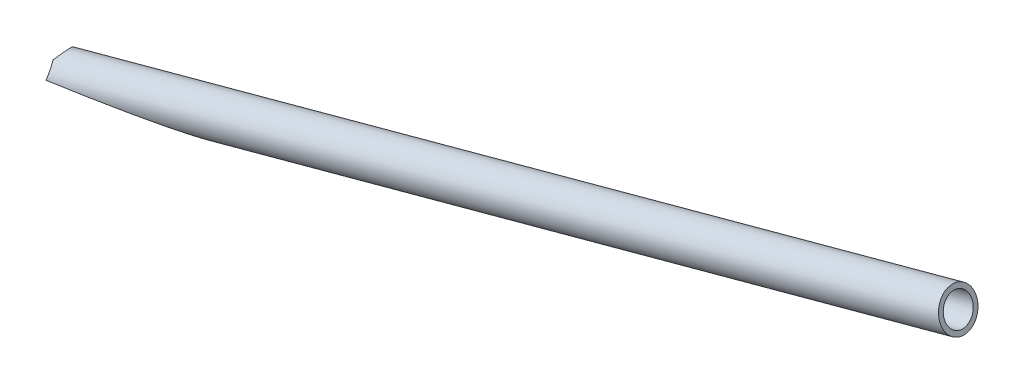
ISO-10303-21;
HEADER;
FILE_DESCRIPTION(('STEP AP214'),'2;1');
FILE_NAME('part.step','',(''),(''),'','','');
FILE_SCHEMA(('AUTOMOTIVE_DESIGN { 1 0 10303 214 1 1 1 1 }'));
ENDSEC;
DATA;
#1=APPLICATION_CONTEXT('core data for automotive mechanical design processes');
#2=APPLICATION_PROTOCOL_DEFINITION('international standard','automotive_design',2000,#1);
#3=PRODUCT_CONTEXT('',#1,'mechanical');
#4=PRODUCT('Part','Part','',(#3));
#5=PRODUCT_RELATED_PRODUCT_CATEGORY('part','',(#4));
#6=PRODUCT_DEFINITION_FORMATION('','',#4);
#7=PRODUCT_DEFINITION_CONTEXT('part definition',#1,'design');
#8=PRODUCT_DEFINITION('design','',#6,#7);
#9=PRODUCT_DEFINITION_SHAPE('','',#8);
#10=(LENGTH_UNIT() NAMED_UNIT(*) SI_UNIT(.MILLI.,.METRE.));
#11=(NAMED_UNIT(*) PLANE_ANGLE_UNIT() SI_UNIT($,.RADIAN.));
#12=(NAMED_UNIT(*) SI_UNIT($,.STERADIAN.) SOLID_ANGLE_UNIT());
#13=UNCERTAINTY_MEASURE_WITH_UNIT(LENGTH_MEASURE(1.E-05),#10,'distance_accuracy_value','');
#14=(GEOMETRIC_REPRESENTATION_CONTEXT(3) GLOBAL_UNCERTAINTY_ASSIGNED_CONTEXT((#13)) GLOBAL_UNIT_ASSIGNED_CONTEXT((#10,
#11,#12)) REPRESENTATION_CONTEXT('',''));
#15=CARTESIAN_POINT('',(0.,0.,0.));
#16=DIRECTION('',(0.,0.,1.));
#17=DIRECTION('',(1.,0.,0.));
#18=AXIS2_PLACEMENT_3D('',#15,#16,#17);
#19=CARTESIAN_POINT('',(0.,3.69149155687865E-12,-199.999999999991));
#20=DIRECTION('',(0.974346253790711,0.214414809831052,-0.0683788494281837));
#21=DIRECTION('',(-0.214917840654056,0.976632132263012,0.));
#22=AXIS2_PLACEMENT_3D('',#19,#20,#21);
#23=CYLINDRICAL_SURFACE('',#22,9.65);
#24=CARTESIAN_POINT('',(12.6578481651679,12.6663837757664,-201.033866445696));
#25=CARTESIAN_POINT('',(12.6398762361989,12.6624310107136,-201.253923955807));
#26=CARTESIAN_POINT('',(12.6161641519962,12.649437539128,-201.473326217625));
#27=CARTESIAN_POINT('',(12.5576373291854,12.605684867128,-201.908939145302));
#28=CARTESIAN_POINT('',(12.5228183198362,12.5749188292606,-202.125148549956));
#29=CARTESIAN_POINT('',(12.4427102833345,12.4962733643517,-202.552712250612));
#30=CARTESIAN_POINT('',(12.3974084851258,12.4483730236215,-202.764060275934));
#31=CARTESIAN_POINT('',(12.2972408079726,12.3364553283438,-203.180205559036));
#32=CARTESIAN_POINT('',(12.2423701766244,12.2724299581765,-203.384999501603));
#33=CARTESIAN_POINT('',(12.124658053771,12.1301230113847,-203.784933472554));
#34=CARTESIAN_POINT('',(12.0618933792813,12.0519760182954,-203.98014421948));
#35=CARTESIAN_POINT('',(11.9290777199722,11.8822852603161,-204.362116011763));
#36=CARTESIAN_POINT('',(11.8590234941935,11.7907355290988,-204.54887324525));
#37=CARTESIAN_POINT('',(11.639577281935,11.4978836537146,-205.095505661985));
#38=CARTESIAN_POINT('',(11.4808154367502,11.2782746536856,-205.4420263111));
#39=CARTESIAN_POINT('',(11.190432418675,10.8621725494696,-206.011512087881));
#40=CARTESIAN_POINT('',(11.062531713847,10.6745883920126,-206.243131008751));
#41=CARTESIAN_POINT('',(10.8005672499711,10.2806449109304,-206.686095715315));
#42=CARTESIAN_POINT('',(10.6665028890115,10.074283751703,-206.897439514796));
#43=CARTESIAN_POINT('',(10.394651135223,9.64460689978534,-207.300722045524));
#44=CARTESIAN_POINT('',(10.2568553377505,9.42125044950734,-207.49261137861));
#45=CARTESIAN_POINT('',(9.98049910331886,8.95976217598755,-207.856964681965));
#46=CARTESIAN_POINT('',(9.84193876950019,8.72163230341374,-208.029431208373));
#47=CARTESIAN_POINT('',(9.56275101636566,8.2247416337664,-208.360140206228));
#48=CARTESIAN_POINT('',(9.42217811115553,7.96558521989223,-208.517833583154));
#49=CARTESIAN_POINT('',(9.14612204176194,7.43362168019311,-208.813589596864));
#50=CARTESIAN_POINT('',(9.01063992840097,7.16081176286897,-208.951648196912));
#51=CARTESIAN_POINT('',(8.74862098129519,6.60243641710611,-209.207885168329));
#52=CARTESIAN_POINT('',(8.62207120699322,6.31689046169346,-209.326092656167));
#53=CARTESIAN_POINT('',(8.38212476996069,5.73296047073515,-209.542328562553));
#54=CARTESIAN_POINT('',(8.26872177554578,5.43458271090384,-209.640366712724));
#55=CARTESIAN_POINT('',(8.09708558806915,4.93229150344866,-209.784426704791));
#56=CARTESIAN_POINT('',(8.0334586344406,4.73197906142325,-209.836628232134));
#57=CARTESIAN_POINT('',(7.91581621951402,4.32627837312236,-209.931543955413));
#58=CARTESIAN_POINT('',(7.86180157750337,4.120889695881,-209.974257342721));
#59=CARTESIAN_POINT('',(7.7654314330872,3.70590242157028,-210.049468294951));
#60=CARTESIAN_POINT('',(7.72305609942978,3.49631164633629,-210.081983249724));
#61=CARTESIAN_POINT('',(7.65188291191024,3.07346281235492,-210.136108905582));
#62=CARTESIAN_POINT('',(7.62308030938959,2.86020606331912,-210.157723420564));
#63=CARTESIAN_POINT('',(7.5840301008006,2.46293430934048,-210.1869026467));
#64=CARTESIAN_POINT('',(7.57167243092039,2.27924527361716,-210.196069329884));
#65=CARTESIAN_POINT('',(7.55910229918952,1.91128205319511,-210.205392776827));
#66=CARTESIAN_POINT('',(7.55888415888533,1.72700818240388,-210.205553753145));
#67=CARTESIAN_POINT('',(7.57111146806392,1.35919510542339,-210.196486152877));
#68=CARTESIAN_POINT('',(7.58355042801215,1.17565557114066,-210.187262388026));
#69=CARTESIAN_POINT('',(7.62110775443539,0.810614053342008,-210.159196015921));
#70=CARTESIAN_POINT('',(7.64622639574477,0.6291121140785,-210.140353200172));
#71=CARTESIAN_POINT('',(7.70858828212274,0.269738017119927,-210.093026799924));
#72=CARTESIAN_POINT('',(7.74581564534785,0.0918614274016094,-210.064555841801));
#73=CARTESIAN_POINT('',(7.83142239912595,-0.259350894667046,-209.998087426645));
#74=CARTESIAN_POINT('',(7.87980181929446,-0.432686614957247,-209.960089944314));
#75=CARTESIAN_POINT('',(7.98648056129009,-0.774179351138876,-209.874755237889));
#76=CARTESIAN_POINT('',(8.04479360878868,-0.942328816094309,-209.827405076204));
#77=CARTESIAN_POINT('',(8.16982550922923,-1.27263780129534,-209.723710668539));
#78=CARTESIAN_POINT('',(8.2365465385888,-1.43479575652514,-209.667364092814));
#79=CARTESIAN_POINT('',(8.40421140879003,-1.81466956729474,-209.522384803946));
#80=CARTESIAN_POINT('',(8.5083666477454,-2.02943966014543,-209.429722458917));
#81=CARTESIAN_POINT('',(8.72617623861614,-2.44637242927899,-209.228533930753));
#82=CARTESIAN_POINT('',(8.8398341913527,-2.64853027532759,-209.120001722348));
#83=CARTESIAN_POINT('',(9.07340057883,-3.04044670567934,-208.88766387065));
#84=CARTESIAN_POINT('',(9.19331669182777,-3.23018938255688,-208.763839197655));
#85=CARTESIAN_POINT('',(9.43633379377179,-3.59708328812163,-208.501621201364));
#86=CARTESIAN_POINT('',(9.55943448758112,-3.77423567797539,-208.363229224496));
#87=CARTESIAN_POINT('',(9.80943586160389,-4.12036480178331,-208.068656995383));
#88=CARTESIAN_POINT('',(9.93635386438755,-4.28902114606731,-207.912115187394));
#89=CARTESIAN_POINT('',(10.1885057334834,-4.61312226082369,-207.584659514661));
#90=CARTESIAN_POINT('',(10.3137395843703,-4.7685669103586,-207.413745518384));
#91=CARTESIAN_POINT('',(10.5603523157501,-5.06598917617145,-207.058030023907));
#92=CARTESIAN_POINT('',(10.6817317832342,-5.20796884966165,-206.873230654905));
#93=CARTESIAN_POINT('',(10.9186642357365,-5.47807908518387,-206.490260349426));
#94=CARTESIAN_POINT('',(11.0342173351285,-5.60620991913046,-206.292089675611));
#95=CARTESIAN_POINT('',(11.2711711661053,-5.8627307823389,-205.858236808069));
#96=CARTESIAN_POINT('',(11.3915868902324,-5.98927515684062,-205.620917495461));
#97=CARTESIAN_POINT('',(11.6202910895961,-6.22333843088086,-205.131453026492));
#98=CARTESIAN_POINT('',(11.7285784422471,-6.33085556981799,-204.879306501032));
#99=CARTESIAN_POINT('',(11.9306695772683,-6.52575896575054,-204.361904630593));
#100=CARTESIAN_POINT('',(12.0244805976349,-6.61315529373897,-204.096655924703));
#101=CARTESIAN_POINT('',(12.1956089575202,-6.7668315764643,-203.554962332424));
#102=CARTESIAN_POINT('',(12.2729290110343,-6.8331150067368,-203.278519297263));
#103=CARTESIAN_POINT('',(12.4020137609956,-6.93771187566469,-202.747105869295));
#104=CARTESIAN_POINT('',(12.4556327981382,-6.97826712946554,-202.493024662068));
#105=CARTESIAN_POINT('',(12.5474293090014,-7.04134963548109,-201.979881023221));
#106=CARTESIAN_POINT('',(12.5856078711688,-7.06387815856538,-201.720818944068));
#107=CARTESIAN_POINT('',(12.6458937918598,-7.09060866253849,-201.200024058387));
#108=CARTESIAN_POINT('',(12.6680090834415,-7.0948196948951,-200.938292635004));
#109=CARTESIAN_POINT('',(12.6959505601862,-7.08488307912286,-200.414316398544));
#110=CARTESIAN_POINT('',(12.7017775756706,-7.07073636686353,-200.152071612319));
#111=CARTESIAN_POINT('',(12.6974854908949,-7.02638106067723,-199.653019217639));
#112=CARTESIAN_POINT('',(12.6887614669976,-6.99774152898652,-199.416056918154));
#113=CARTESIAN_POINT('',(12.6583225686202,-6.92574074384044,-198.945245155895));
#114=CARTESIAN_POINT('',(12.6366086934595,-6.88238062296251,-198.711395455081));
#115=CARTESIAN_POINT('',(12.5807804625198,-6.78136258120894,-198.248327557074));
#116=CARTESIAN_POINT('',(12.5466662905722,-6.72370487229573,-198.019109291273));
#117=CARTESIAN_POINT('',(12.4668217427915,-6.59459963042537,-197.566661851318));
#118=CARTESIAN_POINT('',(12.4210908343341,-6.5231514652156,-197.343432952293));
#119=CARTESIAN_POINT('',(12.3172783751722,-6.36445467237416,-196.89695388946));
#120=CARTESIAN_POINT('',(12.2588404053372,-6.27676404171385,-196.673943996451));
#121=CARTESIAN_POINT('',(12.1317638837514,-6.08788157543605,-196.236738517814));
#122=CARTESIAN_POINT('',(12.0631251871095,-5.98668954804671,-196.022543057441));
#123=CARTESIAN_POINT('',(11.9169096366725,-5.77132538185922,-195.603811985363));
#124=CARTESIAN_POINT('',(11.83932813273,-5.6571464904677,-195.399281477956));
#125=CARTESIAN_POINT('',(11.6766558111603,-5.41634718769224,-195.000796691486));
#126=CARTESIAN_POINT('',(11.5915642830915,-5.28972559911136,-194.806843415836));
#127=CARTESIAN_POINT('',(11.4048782941431,-5.00863538903161,-194.407785078388));
#128=CARTESIAN_POINT('',(11.3025254182596,-4.85264633652122,-194.204103746854));
#129=CARTESIAN_POINT('',(11.0925744884397,-4.52595075442271,-193.81176089959));
#130=CARTESIAN_POINT('',(10.9849756704016,-4.35524207803688,-193.623101582504));
#131=CARTESIAN_POINT('',(10.7670413505968,-3.99922801986563,-193.261649448399));
#132=CARTESIAN_POINT('',(10.6567048707283,-3.81391736815598,-193.088862408939));
#133=CARTESIAN_POINT('',(10.4362267553983,-3.42875620127612,-192.760228241072));
#134=CARTESIAN_POINT('',(10.3260850839405,-3.22890874221459,-192.604377569174));
#135=CARTESIAN_POINT('',(10.1299485626497,-2.8539329609307,-192.338667943792));
#136=CARTESIAN_POINT('',(10.0433427683416,-2.68132491784202,-192.225697398896));
#137=CARTESIAN_POINT('',(9.87452059559322,-2.32645146402938,-192.012363665152));
#138=CARTESIAN_POINT('',(9.79230330811601,-2.14418806902578,-191.911997859482));
#139=CARTESIAN_POINT('',(9.63469280769146,-1.77039481104267,-191.724878296405));
#140=CARTESIAN_POINT('',(9.55928797388502,-1.57888161731496,-191.638101166237));
#141=CARTESIAN_POINT('',(9.41767062537105,-1.18668673887575,-191.478917985521));
#142=CARTESIAN_POINT('',(9.35145605538135,-0.986007117501652,-191.406508720226));
#143=CARTESIAN_POINT('',(9.24135527184902,-0.612218316694561,-191.288358979379));
#144=CARTESIAN_POINT('',(9.19558953536006,-0.440436020904675,-191.240168817652));
#145=CARTESIAN_POINT('',(9.11339257848526,-0.0920091329278726,-191.154684946472));
#146=CARTESIAN_POINT('',(9.07695930815268,0.0846343819985869,-191.117388843804));
#147=CARTESIAN_POINT('',(9.01452615936448,0.441596748755765,-191.054034276173));
#148=CARTESIAN_POINT('',(8.98851771799567,0.621912455790904,-191.027966586916));
#149=CARTESIAN_POINT('',(8.94756888078086,0.985066593299672,-190.98712869965));
#150=CARTESIAN_POINT('',(8.93262869844091,1.16790507236812,-190.972358719574));
#151=CARTESIAN_POINT('',(8.91401972585638,1.53447750382371,-190.953982547385));
#152=CARTESIAN_POINT('',(8.91033662043258,1.71821002107966,-190.95036217671));
#153=CARTESIAN_POINT('',(8.91387078972847,2.08541627583703,-190.953847422917));
#154=CARTESIAN_POINT('',(8.92108807680007,2.26889001304496,-190.960953051952));
#155=CARTESIAN_POINT('',(8.95811723526415,2.81760650173775,-190.997579228416));
#156=CARTESIAN_POINT('',(9.00331539667944,3.18094003101272,-191.042418106262));
#157=CARTESIAN_POINT('',(9.11085621988236,3.80692596846384,-191.152037901851));
#158=CARTESIAN_POINT('',(9.1662148620465,4.07229629097734,-191.209166269455));
#159=CARTESIAN_POINT('',(9.29128777555287,4.59517682949033,-191.341461351586));
#160=CARTESIAN_POINT('',(9.36100951892657,4.85268287391713,-191.416637458361));
#161=CARTESIAN_POINT('',(9.51143702822177,5.3598057475192,-191.583634269941));
#162=CARTESIAN_POINT('',(9.59217629726837,5.60939553516358,-191.675506038663));
#163=CARTESIAN_POINT('',(9.76136101453103,6.09962689397889,-191.87455190867));
#164=CARTESIAN_POINT('',(9.84980603554231,6.34026896015506,-191.981725161854));
#165=CARTESIAN_POINT('',(10.0648306089876,6.89826710437952,-192.25217063275));
#166=CARTESIAN_POINT('',(10.1936003944399,7.21176763098223,-192.421686085692));
#167=CARTESIAN_POINT('',(10.4551295970883,7.82158249574692,-192.786763964987));
#168=CARTESIAN_POINT('',(10.5878906545587,8.11788961729504,-192.982337216707));
#169=CARTESIAN_POINT('',(10.8525496017723,8.69178504600308,-193.39901667652));
#170=CARTESIAN_POINT('',(10.9844484093569,8.96939788957054,-193.620088340729));
#171=CARTESIAN_POINT('',(11.2431791883075,9.50423398046338,-194.087939836212));
#172=CARTESIAN_POINT('',(11.3700136670406,9.76146738140074,-194.334706721756));
#173=CARTESIAN_POINT('',(11.6647308766876,10.3540018970479,-194.961356404109));
#174=CARTESIAN_POINT('',(11.8281366165434,10.6780996001629,-195.35435071307));
#175=CARTESIAN_POINT('',(12.0497030311405,11.1207396014951,-195.982050304333));
#176=CARTESIAN_POINT('',(12.1196170109733,11.2609989127831,-196.197579746624));
#177=CARTESIAN_POINT('',(12.2499634723657,11.5252872416254,-196.641167073955));
#178=CARTESIAN_POINT('',(12.3103981994065,11.649320101804,-196.869221974584));
#179=CARTESIAN_POINT('',(12.4090131975076,11.8560136413997,-197.290144205675));
#180=CARTESIAN_POINT('',(12.4492265683064,11.9419857208629,-197.48091517415));
#181=CARTESIAN_POINT('',(12.5215342432021,12.1010383555539,-197.869234881479));
#182=CARTESIAN_POINT('',(12.5536304449212,12.1741219226313,-198.066782023921));
#183=CARTESIAN_POINT('',(12.6088107884642,12.3061753154177,-198.467449474263));
#184=CARTESIAN_POINT('',(12.6319087051675,12.3651666599978,-198.670560750106));
#185=CARTESIAN_POINT('',(12.6684094192992,12.4681164823572,-199.08135055032));
#186=CARTESIAN_POINT('',(12.6818153952689,12.5120798861615,-199.289027554282));
#187=CARTESIAN_POINT('',(12.7000984010507,12.5917063866263,-199.751613608959));
#188=CARTESIAN_POINT('',(12.7025883320464,12.6236785259711,-200.007269209912));
#189=CARTESIAN_POINT('',(12.6919341974055,12.6633222092557,-200.520201643505));
#190=CARTESIAN_POINT('',(12.6787871505547,12.6709891183438,-200.77747877599));
#191=CARTESIAN_POINT('',(12.6578481651679,12.6663837757664,-201.033866445696));
#192=B_SPLINE_CURVE_WITH_KNOTS('',3,(#24,#25,#26,#27,#28,#29,#30,#31,#32,#33,#34,#35,#36,#37,
#38,#39,#40,#41,#42,#43,#44,#45,#46,#47,#48,#49,#50,#51,#52,#53,#54,#55,#56,#57,#58,#59,#60,#61,
#62,#63,#64,#65,#66,#67,#68,#69,#70,#71,#72,#73,#74,#75,#76,#77,#78,#79,#80,#81,#82,#83,#84,#85,
#86,#87,#88,#89,#90,#91,#92,#93,#94,#95,#96,#97,#98,#99,#100,#101,#102,#103,#104,#105,#106,#107,
#108,#109,#110,#111,#112,#113,#114,#115,#116,#117,#118,#119,#120,#121,#122,#123,#124,#125,#126,
#127,#128,#129,#130,#131,#132,#133,#134,#135,#136,#137,#138,#139,#140,#141,#142,#143,#144,#145,
#146,#147,#148,#149,#150,#151,#152,#153,#154,#155,#156,#157,#158,#159,#160,#161,#162,#163,#164,
#165,#166,#167,#168,#169,#170,#171,#172,#173,#174,#175,#176,#177,#178,#179,#180,#181,#182,#183,
#184,#185,#186,#187,#188,#189,#190,#191),.UNSPECIFIED.,.T.,.F.,(4,2,2,2,2,2,2,2,2,2,2,2,2,2,2,2,
2,2,2,2,2,2,2,2,2,2,2,2,2,2,2,2,2,2,2,2,2,2,2,2,2,2,2,2,2,2,2,2,2,2,2,2,2,2,2,2,2,2,2,2,2,2,2,2,
2,2,2,2,2,2,2,2,2,2,2,2,2,2,2,2,2,2,2,4),(0.,0.662180797317108,1.32461651833598,
1.98786356585248,2.65144096101996,3.30899916252157,3.96685097600643,5.28161859991612,
6.25348755047201,7.22545161128621,8.19982489522394,9.17406979657794,10.1762272565796,
11.1785904543998,12.1794703537284,13.1798661940748,13.8291444890904,14.4784780976482,
15.1266983991938,15.7746917407832,16.3271164713363,16.8792827944677,17.4311661540699,
17.9830614763569,18.5342358301381,19.08541164764,19.6373553164947,20.1894421513306,
20.9564461378308,21.723742090534,22.4920026611235,23.2601922850189,24.0478239229649,
24.8354627699721,25.6229810850531,26.4104839348227,27.2933016159349,28.1762009420277,
29.0586573884357,29.9409684926077,30.7283649551954,31.5157059020922,32.3026577453998,
33.0895694718346,33.8052827234804,34.5209409218238,35.236588511135,35.9522689186201,
36.6914632398829,37.4306680616708,38.1702590095303,38.9099199971858,39.7376897518056,
40.565580438167,41.3937712950054,42.2217885396857,42.8924433657551,43.5629587286959,
44.2323078163634,44.9015069708435,45.4535038352787,46.005379345253,46.5568006133241,
47.108232518001,47.6589628961732,48.2096938984125,49.3117634310654,50.1418498546909,
50.9723692047481,51.805472821664,52.6385302808955,53.7739329542354,54.9098087949824,
56.0441634970833,57.1779494303059,58.776333526467,59.5750370167639,60.3735510204845,
61.012195919492,61.6506913785524,62.2882055298104,62.9255105087778,63.69686625382,
64.4683690826151),.UNSPECIFIED.);
#193=CARTESIAN_POINT('',(12.6676672933685,12.6676672933722,-200.905651889248));
#194=VERTEX_POINT('',#193);
#195=CARTESIAN_POINT('',(12.1046465312153,12.1046465312189,-203.842854714176));
#196=VERTEX_POINT('',#195);
#197=EDGE_CURVE('E117',#194,#196,#192,.T.);
#198=ORIENTED_EDGE('',*,*,#197,.T.);
#199=CARTESIAN_POINT('',(12.6200439898743,12.6580645822304,-201.031213378576));
#200=CARTESIAN_POINT('',(12.5514884848631,12.6429822058329,-201.216385667732));
#201=CARTESIAN_POINT('',(12.4895737586561,12.6236294874,-201.403629018516));
#202=CARTESIAN_POINT('',(12.3792986976069,12.5759363659917,-201.78100295267));
#203=CARTESIAN_POINT('',(12.3309406182175,12.5475944691342,-201.971134010934));
#204=CARTESIAN_POINT('',(12.24801376047,12.4816397782159,-202.352918840367));
#205=CARTESIAN_POINT('',(12.2134537988497,12.4440210812058,-202.544573505586));
#206=CARTESIAN_POINT('',(12.1583159211233,12.3594618010821,-202.927833360554));
#207=CARTESIAN_POINT('',(12.1377374584449,12.3125215824632,-203.119438551944));
#208=CARTESIAN_POINT('',(12.1106398658542,12.2094418756148,-203.501234236045));
#209=CARTESIAN_POINT('',(12.104125547096,12.1532992464289,-203.691424222468));
#210=CARTESIAN_POINT('',(12.1051954700346,12.0321699607772,-204.068928812501));
#211=CARTESIAN_POINT('',(12.1127798655472,11.9671832078299,-204.25624338472));
#212=CARTESIAN_POINT('',(12.1420157599399,11.8289200408482,-204.62663172299));
#213=CARTESIAN_POINT('',(12.1636649632903,11.7556449811669,-204.809706176027));
#214=CARTESIAN_POINT('',(12.2209402539724,11.6015275862091,-205.170398515698));
#215=CARTESIAN_POINT('',(12.2565662331823,11.5206853094748,-205.348016444532));
#216=CARTESIAN_POINT('',(12.341327368083,11.352951478837,-205.695386202557));
#217=CARTESIAN_POINT('',(12.3903621356412,11.2661083271138,-205.865185941131));
#218=CARTESIAN_POINT('',(12.5018137083355,11.0868879589336,-206.197299583663));
#219=CARTESIAN_POINT('',(12.564230340948,10.9945108138338,-206.359613584096));
#220=CARTESIAN_POINT('',(12.7021035467224,10.8053816593983,-206.675902831898));
#221=CARTESIAN_POINT('',(12.7775585042511,10.7086301931985,-206.829879109328));
#222=CARTESIAN_POINT('',(12.9410686410392,10.5119670178944,-207.128854859227));
#223=CARTESIAN_POINT('',(13.0291241362175,10.4120552296039,-207.273854106495));
#224=CARTESIAN_POINT('',(13.2203333559997,10.2070483017232,-207.558967652489));
#225=CARTESIAN_POINT('',(13.3238850608608,10.1018902766045,-207.698769582186));
#226=CARTESIAN_POINT('',(13.543108136242,9.89087509280354,-207.968053098162));
#227=CARTESIAN_POINT('',(13.6587842298201,9.78501767683164,-208.097530627728));
#228=CARTESIAN_POINT('',(13.9013545866516,9.57393056780113,-208.346043280068));
#229=CARTESIAN_POINT('',(14.0282486905499,9.46870086584832,-208.46507855113));
#230=CARTESIAN_POINT('',(14.2923114754155,9.26000643984434,-208.692879447019));
#231=CARTESIAN_POINT('',(14.4294823530172,9.15654209897036,-208.801642864968));
#232=CARTESIAN_POINT('',(14.7745148319193,8.90816557137128,-209.054177572966));
#233=CARTESIAN_POINT('',(14.9872698523371,8.76470252408172,-209.19271823896));
#234=CARTESIAN_POINT('',(15.4288275781258,8.48568145048533,-209.450893342316));
#235=CARTESIAN_POINT('',(15.6576363490334,8.35012644786337,-209.570520577535));
#236=CARTESIAN_POINT('',(16.1287247291115,8.08817665960097,-209.792903474185));
#237=CARTESIAN_POINT('',(16.3710221577666,7.96179452500053,-209.895636072929));
#238=CARTESIAN_POINT('',(16.866349456575,7.71904788174814,-210.086135155714));
#239=CARTESIAN_POINT('',(17.1193834798109,7.60268730330332,-210.173895781231));
#240=CARTESIAN_POINT('',(17.5949672642718,7.39703043801438,-210.324126353507));
#241=CARTESIAN_POINT('',(17.8163350320472,7.30630334763399,-210.388413738999));
#242=CARTESIAN_POINT('',(18.2640264612156,7.13209243953741,-210.508780500765));
#243=CARTESIAN_POINT('',(18.4903491494395,7.04860721518835,-210.564861472484));
#244=CARTESIAN_POINT('',(18.9472379275603,6.88854175454515,-210.669918455592));
#245=CARTESIAN_POINT('',(19.1778072103569,6.81196699245586,-210.718888852633));
#246=CARTESIAN_POINT('',(19.6422689710235,6.6654463303555,-210.810610215522));
#247=CARTESIAN_POINT('',(19.8761616744349,6.59550088273207,-210.853360757029));
#248=CARTESIAN_POINT('',(20.347366425455,6.46164637472803,-210.933582707817));
#249=CARTESIAN_POINT('',(20.5846868862218,6.39775690022453,-210.97103716882));
#250=CARTESIAN_POINT('',(21.0615109385366,6.27585265044731,-211.041223527465));
#251=CARTESIAN_POINT('',(21.3010144918539,6.21783777251105,-211.07395550764));
#252=CARTESIAN_POINT('',(21.7816903373641,6.10729438366822,-211.135301961545));
#253=CARTESIAN_POINT('',(22.0228618569443,6.05476349314119,-211.163918223228));
#254=CARTESIAN_POINT('',(22.5066394643358,5.9547635058449,-211.217575499977));
#255=CARTESIAN_POINT('',(22.7492455527912,5.90729441134851,-211.242616513437));
#256=CARTESIAN_POINT('',(23.4304079425107,5.78088841577531,-211.308394515495));
#257=CARTESIAN_POINT('',(23.8702810300244,5.70719809335178,-211.345639791999));
#258=CARTESIAN_POINT('',(24.7526566217972,5.57297462538384,-211.412165538318));
#259=CARTESIAN_POINT('',(25.195159555099,5.51244369081415,-211.441444669908));
#260=CARTESIAN_POINT('',(26.0822146486873,5.4027795153992,-211.493635498939));
#261=CARTESIAN_POINT('',(26.5267679162322,5.35365341672946,-211.516543208103));
#262=CARTESIAN_POINT('',(27.4170592195438,5.26536310083526,-211.557175352317));
#263=CARTESIAN_POINT('',(27.8627971915658,5.22619835816772,-211.574900060768));
#264=CARTESIAN_POINT('',(28.7562030186817,5.1564789071436,-211.606126939483));
#265=CARTESIAN_POINT('',(29.203872914792,5.12594590396902,-211.619618474289));
#266=CARTESIAN_POINT('',(30.0997603044461,5.07254416136586,-211.643029706637));
#267=CARTESIAN_POINT('',(30.5479778040508,5.04967550755161,-211.652949364279));
#268=CARTESIAN_POINT('',(31.4446124277796,5.01069634313956,-211.669763132895));
#269=CARTESIAN_POINT('',(31.8930294396718,4.99458363841084,-211.676658226191));
#270=CARTESIAN_POINT('',(32.7900739306135,4.9683369105392,-211.687849346989));
#271=CARTESIAN_POINT('',(33.2387014135455,4.95820300240095,-211.692145324496));
#272=CARTESIAN_POINT('',(34.5899039142449,4.93566812500637,-211.701687960307));
#273=CARTESIAN_POINT('',(35.4926423121933,4.93134232373912,-211.703500890956));
#274=CARTESIAN_POINT('',(37.2980365951206,4.93986616259208,-211.699901490167));
#275=CARTESIAN_POINT('',(38.20069247161,4.95271685908404,-211.694488714341));
#276=CARTESIAN_POINT('',(40.0042457084497,4.99244224757276,-211.677584585983));
#277=CARTESIAN_POINT('',(40.9051436470414,5.01929546313457,-211.666102541853));
#278=CARTESIAN_POINT('',(42.7064398868834,5.08465937236917,-211.637761874703));
#279=CARTESIAN_POINT('',(43.6068381775237,5.12317030476219,-211.620903141582));
#280=CARTESIAN_POINT('',(45.3050222949321,5.20513608007349,-211.584400492051));
#281=CARTESIAN_POINT('',(46.1028712986815,5.24753581073377,-211.565288843703));
#282=CARTESIAN_POINT('',(47.6980842772109,5.33911916725714,-211.523295703276));
#283=CARTESIAN_POINT('',(48.4954482484094,5.38830284261876,-211.500414183689));
#284=CARTESIAN_POINT('',(50.0896937137597,5.49267076962071,-211.450934649207));
#285=CARTESIAN_POINT('',(50.8865751906413,5.54785522460118,-211.424336508362));
#286=CARTESIAN_POINT('',(52.4798150391159,5.66360120655427,-211.367399816331));
#287=CARTESIAN_POINT('',(53.2761734080669,5.72416276047693,-211.337061246397));
#288=CARTESIAN_POINT('',(55.6656667181384,5.91322601439389,-211.240277521703));
#289=CARTESIAN_POINT('',(57.2580003630176,6.04902480507719,-211.168102011288));
#290=CARTESIAN_POINT('',(60.4402742472308,6.33715819308004,-211.007165085053));
#291=CARTESIAN_POINT('',(62.0302145513468,6.48949233436032,-210.918404126606));
#292=CARTESIAN_POINT('',(65.1982126953933,6.80808869020896,-210.722629556941));
#293=CARTESIAN_POINT('',(66.7762858399357,6.97426469239093,-210.615725171749));
#294=CARTESIAN_POINT('',(69.141047857056,7.23401573800547,-210.438866717435));
#295=CARTESIAN_POINT('',(69.9289368434117,7.32235038433252,-210.377161251094));
#296=CARTESIAN_POINT('',(71.5038117264707,7.5025209964299,-210.24765847044));
#297=CARTESIAN_POINT('',(72.290797628826,7.59435694016293,-210.179861194466));
#298=CARTESIAN_POINT('',(73.8632323078545,7.78152513854197,-210.037513766333));
#299=CARTESIAN_POINT('',(74.6486817439112,7.87685513168588,-209.962967937754));
#300=CARTESIAN_POINT('',(76.2183524948895,8.0711963403232,-209.80619123137));
#301=CARTESIAN_POINT('',(77.0025738234531,8.17020751461937,-209.723960439553));
#302=CARTESIAN_POINT('',(78.5694650090496,8.37212306836393,-209.550667932541));
#303=CARTESIAN_POINT('',(79.35213500719,8.47502707484534,-209.459607062044));
#304=CARTESIAN_POINT('',(80.9156232174877,8.68507312150091,-209.26713748386));
#305=CARTESIAN_POINT('',(81.6964414823521,8.79221503947626,-209.165729074409));
#306=CARTESIAN_POINT('',(82.8657249348383,8.95647444247092,-209.004300544557));
#307=CARTESIAN_POINT('',(83.2550879573624,9.01180776403986,-208.948949835966));
#308=CARTESIAN_POINT('',(84.0331248065767,9.12375328635563,-208.834790642357));
#309=CARTESIAN_POINT('',(84.4217986329698,9.18036548765363,-208.775982155847));
#310=CARTESIAN_POINT('',(85.1984458270446,9.29499112524384,-208.654485365895));
#311=CARTESIAN_POINT('',(85.5864189725726,9.35300494279544,-208.591795999385));
#312=CARTESIAN_POINT('',(86.3614042452678,9.47055317708693,-208.462049892733));
#313=CARTESIAN_POINT('',(86.7484163763974,9.53008758754578,-208.394993170628));
#314=CARTESIAN_POINT('',(87.523089227308,9.65112955145953,-208.255559651624));
#315=CARTESIAN_POINT('',(87.9107445083886,9.71264503413468,-208.183159429265));
#316=CARTESIAN_POINT('',(88.6846032741595,9.83760308978128,-208.032505783851));
#317=CARTESIAN_POINT('',(89.070806782642,9.90104563101532,-207.954252457162));
#318=CARTESIAN_POINT('',(89.8411869138308,10.0301179071237,-207.790864881586));
#319=CARTESIAN_POINT('',(90.2253644627497,10.0957465197356,-207.705734132314));
#320=CARTESIAN_POINT('',(90.9913047539026,10.2296107628735,-207.527120209335));
#321=CARTESIAN_POINT('',(91.3730676611105,10.2978462130018,-207.433637612994));
#322=CARTESIAN_POINT('',(92.1356648066775,10.4379107807442,-207.235663070737));
#323=CARTESIAN_POINT('',(92.5164789248328,10.5097594037138,-207.131107006269));
#324=CARTESIAN_POINT('',(93.2737722377485,10.6575553149253,-206.908294257877));
#325=CARTESIAN_POINT('',(93.6502469861494,10.7335064199098,-206.790024694114));
#326=CARTESIAN_POINT('',(94.2079465866371,10.8511546111089,-206.599084257103));
#327=CARTESIAN_POINT('',(94.3920050669681,10.8908363126328,-206.533450710606));
#328=CARTESIAN_POINT('',(94.7576857679831,10.97176210685,-206.396622389169));
#329=CARTESIAN_POINT('',(94.9393083062722,11.0130059931264,-206.325428347645));
#330=CARTESIAN_POINT('',(95.2990274551936,11.0973087998041,-206.176330719481));
#331=CARTESIAN_POINT('',(95.4771290202143,11.1403648565339,-206.098437529848));
#332=CARTESIAN_POINT('',(95.8287297791837,11.2287659281394,-205.934101184009));
#333=CARTESIAN_POINT('',(96.0022312104541,11.2741097979627,-205.847662284556));
#334=CARTESIAN_POINT('',(96.2460612748323,11.3412024198946,-205.715690229815));
#335=CARTESIAN_POINT('',(96.3191788796894,11.3617725081102,-205.674710671696));
#336=CARTESIAN_POINT('',(96.4638252677863,11.4035282025346,-205.590327436479));
#337=CARTESIAN_POINT('',(96.5353538950091,11.4247138687179,-205.5469235228));
#338=CARTESIAN_POINT('',(96.7476837092025,11.4895024116442,-205.412148137834));
#339=CARTESIAN_POINT('',(96.8855838308283,11.5341622629872,-205.316552981747));
#340=CARTESIAN_POINT('',(97.150851762227,11.627687734765,-205.10883488979));
#341=CARTESIAN_POINT('',(97.2780131777058,11.6766096908896,-204.996469667799));
#342=CARTESIAN_POINT('',(97.5082767013584,11.7786192471229,-204.750952475762));
#343=CARTESIAN_POINT('',(97.6115719705706,11.8316683958427,-204.61798307947));
#344=CARTESIAN_POINT('',(97.7277838316738,11.9102402674347,-204.409168052959));
#345=CARTESIAN_POINT('',(97.7588940422864,11.9345100994498,-204.343122912173));
#346=CARTESIAN_POINT('',(97.8098503516197,11.983220399193,-204.206857663134));
#347=CARTESIAN_POINT('',(97.8297100395755,12.0076606248115,-204.136642705306));
#348=CARTESIAN_POINT('',(97.8561048707895,12.0562187051955,-203.992915195378));
#349=CARTESIAN_POINT('',(97.862531901466,12.0803324039892,-203.919380717226));
#350=CARTESIAN_POINT('',(97.8608449443811,12.1271551745814,-203.772013508382));
#351=CARTESIAN_POINT('',(97.8527274757564,12.149863908791,-203.698180710515));
#352=CARTESIAN_POINT('',(97.8243346388665,12.1913351050686,-203.558958435126));
#353=CARTESIAN_POINT('',(97.8051580046127,12.2102689663802,-203.493386756856));
#354=CARTESIAN_POINT('',(97.7573691708178,12.2461981752298,-203.365273094501));
#355=CARTESIAN_POINT('',(97.7287530138278,12.2631927056891,-203.302732393765));
#356=CARTESIAN_POINT('',(97.6402190378018,12.3070981670527,-203.136442163219));
#357=CARTESIAN_POINT('',(97.5727630149376,12.3321037069075,-203.036234222381));
#358=CARTESIAN_POINT('',(97.4234703976237,12.3774029777725,-202.845966025611));
#359=CARTESIAN_POINT('',(97.3415817096239,12.397679000165,-202.755944538087));
#360=CARTESIAN_POINT('',(97.1424313459732,12.4401333891732,-202.558544021319));
#361=CARTESIAN_POINT('',(97.0219681632058,12.4610278187408,-202.454166235038));
#362=CARTESIAN_POINT('',(96.7715582384389,12.4983461167863,-202.256423177481));
#363=CARTESIAN_POINT('',(96.6415926943373,12.5147608001691,-202.16308075137));
#364=CARTESIAN_POINT('',(96.3748667805635,12.5443145511815,-201.984538160453));
#365=CARTESIAN_POINT('',(96.2380735401839,12.5574354720409,-201.899384632175));
#366=CARTESIAN_POINT('',(95.9603964303612,12.5810518750144,-201.736059491067));
#367=CARTESIAN_POINT('',(95.8195167284031,12.5915499337318,-201.65788107508));
#368=CARTESIAN_POINT('',(95.4020328593421,12.61932853171,-201.436754847414));
#369=CARTESIAN_POINT('',(95.1212723202833,12.6338147687179,-201.301328766821));
#370=CARTESIAN_POINT('',(94.5529763049756,12.6575933833258,-201.044875288526));
#371=CARTESIAN_POINT('',(94.2654361983587,12.6668820973004,-200.923858094528));
#372=CARTESIAN_POINT('',(93.6852816387775,12.6816369274981,-200.692490654308));
#373=CARTESIAN_POINT('',(93.3926572720788,12.6870944447402,-200.582164879546));
#374=CARTESIAN_POINT('',(92.8042621868645,12.6950481181495,-200.370116020165));
#375=CARTESIAN_POINT('',(92.508491130979,12.6975439534873,-200.268393868657));
#376=CARTESIAN_POINT('',(91.9141785159529,12.7001777925676,-200.07179747313));
#377=CARTESIAN_POINT('',(91.6156333942756,12.7003121626215,-199.97693400617));
#378=CARTESIAN_POINT('',(91.0167410592834,12.6986463530164,-199.793052187221));
#379=CARTESIAN_POINT('',(90.7163937292489,12.6968460466839,-199.704034218372));
#380=CARTESIAN_POINT('',(90.1147397802063,12.6916354250163,-199.531107244224));
#381=CARTESIAN_POINT('',(89.8134352846946,12.688227536365,-199.447190752934));
#382=CARTESIAN_POINT('',(89.2096920802098,12.6800452932953,-199.28366241442));
#383=CARTESIAN_POINT('',(88.907253401812,12.6752709754553,-199.204050452035));
#384=CARTESIAN_POINT('',(88.0044501555584,12.6593000784742,-198.972374555948));
#385=CARTESIAN_POINT('',(87.4027041566872,12.6463961712438,-198.825802123352));
#386=CARTESIAN_POINT('',(86.1965412448047,12.6170996445048,-198.544410972964));
#387=CARTESIAN_POINT('',(85.5921241530911,12.6007067880085,-198.409593054477));
#388=CARTESIAN_POINT('',(84.3811470253031,12.5651712692477,-198.149682951077));
#389=CARTESIAN_POINT('',(83.7745865345298,12.5460279845092,-198.024592977686));
#390=CARTESIAN_POINT('',(82.5598848965964,12.5055447177883,-197.782710376516));
#391=CARTESIAN_POINT('',(81.9517437267676,12.4842047041309,-197.66591786842));
#392=CARTESIAN_POINT('',(80.733358131043,12.4397191931526,-197.439389333693));
#393=CARTESIAN_POINT('',(80.1231119672938,12.4165712710577,-197.329663156982));
#394=CARTESIAN_POINT('',(78.9015607454161,12.3688303396915,-197.116611336968));
#395=CARTESIAN_POINT('',(78.2902556816047,12.3442373226412,-197.013285728127));
#396=CARTESIAN_POINT('',(76.4551722476385,12.2687235586666,-196.711922140551));
#397=CARTESIAN_POINT('',(75.2300519312583,12.2160615913811,-196.522465531474));
#398=CARTESIAN_POINT('',(72.7790687345251,12.1079428654596,-196.16297312466));
#399=CARTESIAN_POINT('',(71.5532099786209,12.0524905848626,-195.992907555117));
#400=CARTESIAN_POINT('',(69.0993236039085,11.9400991416145,-195.669488579463));
#401=CARTESIAN_POINT('',(67.8712959162221,11.8831599309218,-195.516135714156));
#402=CARTESIAN_POINT('',(65.4142316035247,11.7690685819783,-195.224701990239));
#403=CARTESIAN_POINT('',(64.1851961013197,11.7119166004456,-195.086611572481));
#404=CARTESIAN_POINT('',(61.72558497862,11.5985578369017,-194.824692698115));
#405=CARTESIAN_POINT('',(60.495009383048,11.5423510398023,-194.700864013659));
#406=CARTESIAN_POINT('',(57.9695913949154,11.4293145992666,-194.461118624677));
#407=CARTESIAN_POINT('',(56.6746748345868,11.3725996106971,-194.345928418434));
#408=CARTESIAN_POINT('',(54.0832381248662,11.2632002073962,-194.13102655894));
#409=CARTESIAN_POINT('',(52.7867178125983,11.2105162433153,-194.031316635038));
#410=CARTESIAN_POINT('',(50.1927820325716,11.1111281168506,-193.848279367354));
#411=CARTESIAN_POINT('',(48.8953670924383,11.0644216889643,-193.764945810434));
#412=CARTESIAN_POINT('',(46.2992715360742,10.9793453849327,-193.616324729273));
#413=CARTESIAN_POINT('',(45.000590985712,10.9409750960128,-193.55103631146));
#414=CARTESIAN_POINT('',(42.8178073967043,10.8861243452274,-193.459038793278));
#415=CARTESIAN_POINT('',(41.9340206798845,10.8665682322009,-193.426669816364));
#416=CARTESIAN_POINT('',(40.1659934956529,10.8339944960901,-193.373118922198));
#417=CARTESIAN_POINT('',(39.2817530375148,10.8209767443147,-193.351936784761));
#418=CARTESIAN_POINT('',(37.512509363849,10.8029890500501,-193.322745079619));
#419=CARTESIAN_POINT('',(36.6275059886347,10.7980231751752,-193.314742169712));
#420=CARTESIAN_POINT('',(34.8575142786232,10.7980401554385,-193.314766118363));
#421=CARTESIAN_POINT('',(33.9725259450372,10.803022548424,-193.322792232284));
#422=CARTESIAN_POINT('',(32.2956194497507,10.8241286382137,-193.357060404098));
#423=CARTESIAN_POINT('',(31.5036507159412,10.8390322074391,-193.381308877084));
#424=CARTESIAN_POINT('',(30.3165311867215,10.8703581129283,-193.43298499592));
#425=CARTESIAN_POINT('',(29.9209247432931,10.8822967886439,-193.452763634842));
#426=CARTESIAN_POINT('',(29.1301606380878,10.9094668665181,-193.498135369299));
#427=CARTESIAN_POINT('',(28.7350029669859,10.9246981989536,-193.523728341714));
#428=CARTESIAN_POINT('',(27.9453059236835,10.9587744825165,-193.581558656432));
#429=CARTESIAN_POINT('',(27.5507665808741,10.9776196004628,-193.61379630547));
#430=CARTESIAN_POINT('',(26.7625999374708,11.0192646096464,-193.68592475859));
#431=CARTESIAN_POINT('',(26.3689726117666,11.0420643906575,-193.72581534937));
#432=CARTESIAN_POINT('',(25.583095479803,11.0919661677778,-193.814461891516));
#433=CARTESIAN_POINT('',(25.1908453029956,11.119066898643,-193.863215236269));
#434=CARTESIAN_POINT('',(24.4081279268351,11.177923778252,-193.971086807223));
#435=CARTESIAN_POINT('',(24.0176606531727,11.2096797311114,-194.030204597326));
#436=CARTESIAN_POINT('',(23.1718250119248,11.2840942230728,-194.171901003807));
#437=CARTESIAN_POINT('',(22.7169150190754,11.3276884857192,-194.256769005462));
#438=CARTESIAN_POINT('',(21.8121654481738,11.422086747871,-194.446871983826));
#439=CARTESIAN_POINT('',(21.3623247308093,11.472889091022,-194.552102283472));
#440=CARTESIAN_POINT('',(20.4704582148452,11.5816764969762,-194.787362763344));
#441=CARTESIAN_POINT('',(20.0284249933459,11.6396542653128,-194.917367829214));
#442=CARTESIAN_POINT('',(19.1553694299427,11.7621893168572,-195.207728783472));
#443=CARTESIAN_POINT('',(18.7243420921038,11.8267435459158,-195.368070612667));
#444=CARTESIAN_POINT('',(18.0245476746172,11.9374392164673,-195.663757092676));
#445=CARTESIAN_POINT('',(17.7511405131459,11.9822424125425,-195.788617850378));
#446=CARTESIAN_POINT('',(17.2132841138501,12.0728769355148,-196.055940216649));
#447=CARTESIAN_POINT('',(16.9488321617663,12.1187079437605,-196.198396430209));
#448=CARTESIAN_POINT('',(16.431429848261,12.2099728062556,-196.502610965233));
#449=CARTESIAN_POINT('',(16.1784689655185,12.2554069917355,-196.664351117311));
#450=CARTESIAN_POINT('',(15.6867792922946,12.3439380350802,-197.008546524228));
#451=CARTESIAN_POINT('',(15.4480461129411,12.3870356133526,-197.190995340019));
#452=CARTESIAN_POINT('',(14.8624471049952,12.49061660041,-197.683195987418));
#453=CARTESIAN_POINT('',(14.527371399726,12.5478106765979,-198.008224135276));
#454=CARTESIAN_POINT('',(14.0657289982235,12.6162332050481,-198.53313217715));
#455=CARTESIAN_POINT('',(13.9187308019143,12.6361411476447,-198.714243795666));
#456=CARTESIAN_POINT('',(13.6396086654818,12.6686154345411,-199.088190657918));
#457=CARTESIAN_POINT('',(13.5074798213461,12.6811842051116,-199.281022003903));
#458=CARTESIAN_POINT('',(13.2302157505287,12.6993572391502,-199.723855085829));
#459=CARTESIAN_POINT('',(13.0893298533565,12.7026283704913,-199.976636605341));
#460=CARTESIAN_POINT('',(12.8342587755473,12.6929885754527,-200.495210764473));
#461=CARTESIAN_POINT('',(12.7200812448446,12.680073019525,-200.76100710556));
#462=CARTESIAN_POINT('',(12.6200439898743,12.6580645822304,-201.031213378576));
#463=B_SPLINE_CURVE_WITH_KNOTS('',3,(#199,#200,#201,#202,#203,#204,#205,#206,#207,#208,#209,
#210,#211,#212,#213,#214,#215,#216,#217,#218,#219,#220,#221,#222,#223,#224,#225,#226,#227,#228,
#229,#230,#231,#232,#233,#234,#235,#236,#237,#238,#239,#240,#241,#242,#243,#244,#245,#246,#247,
#248,#249,#250,#251,#252,#253,#254,#255,#256,#257,#258,#259,#260,#261,#262,#263,#264,#265,#266,
#267,#268,#269,#270,#271,#272,#273,#274,#275,#276,#277,#278,#279,#280,#281,#282,#283,#284,#285,
#286,#287,#288,#289,#290,#291,#292,#293,#294,#295,#296,#297,#298,#299,#300,#301,#302,#303,#304,
#305,#306,#307,#308,#309,#310,#311,#312,#313,#314,#315,#316,#317,#318,#319,#320,#321,#322,#323,
#324,#325,#326,#327,#328,#329,#330,#331,#332,#333,#334,#335,#336,#337,#338,#339,#340,#341,#342,
#343,#344,#345,#346,#347,#348,#349,#350,#351,#352,#353,#354,#355,#356,#357,#358,#359,#360,#361,
#362,#363,#364,#365,#366,#367,#368,#369,#370,#371,#372,#373,#374,#375,#376,#377,#378,#379,#380,
#381,#382,#383,#384,#385,#386,#387,#388,#389,#390,#391,#392,#393,#394,#395,#396,#397,#398,#399,
#400,#401,#402,#403,#404,#405,#406,#407,#408,#409,#410,#411,#412,#413,#414,#415,#416,#417,#418,
#419,#420,#421,#422,#423,#424,#425,#426,#427,#428,#429,#430,#431,#432,#433,#434,#435,#436,#437,
#438,#439,#440,#441,#442,#443,#444,#445,#446,#447,#448,#449,#450,#451,#452,#453,#454,#455,#456,
#457,#458,#459,#460,#461,#462),.UNSPECIFIED.,.T.,.F.,(4,2,2,2,2,2,2,2,2,2,2,2,2,2,2,2,2,2,2,2,2,
2,2,2,2,2,2,2,2,2,2,2,2,2,2,2,2,2,2,2,2,2,2,2,2,2,2,2,2,2,2,2,2,2,2,2,2,2,2,2,2,2,2,2,2,2,2,2,2,
2,2,2,2,2,2,2,2,2,2,2,2,2,2,2,2,2,2,2,2,2,2,2,2,2,2,2,2,2,2,2,2,2,2,2,2,2,2,2,2,2,2,2,2,2,2,2,2,
2,2,2,2,2,2,2,2,2,2,2,2,2,2,4),(0.,0.593854858940082,1.18780846042303,1.78214098199753,
2.37645026826728,2.97096282753862,3.56548187292887,4.15990391071558,4.75432135025595,
5.34440493898926,5.93448092062249,6.52448383584804,7.11450154613505,7.72371349341435,
8.33316364761703,8.94260514579332,9.55217728425849,10.4256641642399,11.2994828668718,
12.1744846825185,13.0498281043911,13.7926962532102,14.5354197854959,15.2787266031363,
16.0220841079268,16.7677690951653,17.5134410488056,18.2587880825051,19.0041354508815,
20.3464403987602,21.6889707000246,23.0323394943907,24.3756374138363,25.7222837105641,
27.0689450494528,28.4151686934732,29.7614182318253,32.4693971164636,35.1775425521676,
37.8815465204309,40.5856058635267,42.9831753123985,45.3807622558802,47.7784304684159,
50.1761106987517,54.9751391501191,59.7740352795502,64.5450045607694,66.9306484928169,
69.3162774120095,71.7003886083099,74.0844731313107,76.4683298140352,78.8521178090569,
80.0435570416275,81.2349967876981,82.4267643545477,83.6185269994177,84.8158661318583,
86.0131855555836,87.2098995085758,88.4065307963944,89.6105149097745,90.8156391174453,
91.413762257633,92.0118066395314,92.6089390571613,93.2057755181793,93.4646450895771,
93.723539967258,94.24357402318,94.7720180779605,95.296022350176,95.5260678477256,
95.7558348831415,95.987444184522,96.2191089232186,96.430968158962,96.6429163282228,
97.0108301686029,97.3801002258167,97.8612173560089,98.3433136624983,98.8280104676557,
99.3122292356035,100.247615210374,101.183659691265,102.121798430097,103.060038785212,
103.999722725117,104.939468194808,105.877799613673,106.816105916319,108.674346299548,
110.532712944545,112.391500837552,114.250315536469,116.111667570653,117.973029625376,
121.695223660696,125.411623644916,129.128143852151,132.84232298448,136.556442769589,
140.460146949842,144.364286911134,148.266942782989,152.16940536575,154.823115172397,
157.476772745507,160.131770465346,162.786644848562,165.163768373034,166.352563966597,
167.541334389454,168.730159701286,169.918951882964,171.107394994432,172.295788112415,
173.6897727142,175.08343750768,176.475696976904,177.86731279442,178.778443806632,
179.689296143809,180.599296956169,181.509015588554,182.913408317563,183.615005304721,
184.316370218107,185.182684597453,186.049246807585),.UNSPECIFIED.);
#464=EDGE_CURVE('E59',#196,#194,#463,.T.);
#465=ORIENTED_EDGE('',*,*,#464,.T.);
#466=EDGE_LOOP('',(#198,#465));
#467=FACE_BOUND('',#466,.T.);
#468=CARTESIAN_POINT('',(549.763263321791,120.981001464972,-238.581950982585));
#469=DIRECTION('',(0.949282258198058,0.31052841673289,-0.0493487251280248));
#470=DIRECTION('',(0.29621000873206,-0.935849575324686,-0.190906267816326));
#471=AXIS2_PLACEMENT_3D('',#468,#469,#470);
#472=ELLIPSE('',#471,9.6996046264727,9.65);
#473=CARTESIAN_POINT('',(552.636383292896,111.90363059447,-240.433666301119));
#474=VERTEX_POINT('',#473);
#475=EDGE_CURVE('E44',#474,#474,#472,.T.);
#476=ORIENTED_EDGE('',*,*,#475,.T.);
#477=EDGE_LOOP('',(#476));
#478=FACE_BOUND('',#477,.T.);
#479=ADVANCED_FACE('F40',(#467,#478),#23,.F.);
#480=CARTESIAN_POINT('',(0.,3.69149155687865E-12,-199.999999999991));
#481=DIRECTION('',(0.974346253790711,0.214414809831052,-0.0683788494281837));
#482=DIRECTION('',(-0.214917840654056,0.976632132263012,0.));
#483=AXIS2_PLACEMENT_3D('',#480,#481,#482);
#484=CYLINDRICAL_SURFACE('',#483,12.7);
#485=CARTESIAN_POINT('',(-2.22044604925031E-13,3.6498581934552E-12,-199.999999999991));
#486=DIRECTION('',(-0.113255786186158,0.946595388418525,-0.301877951364683));
#487=DIRECTION('',(0.9935658643972,0.107901658820136,-0.0344108286518605));
#488=AXIS2_PLACEMENT_3D('',#485,#486,#487);
#489=ELLIPSE('',#488,112.135551106634,12.7);
#490=CARTESIAN_POINT('',(3.47897724068086,-3.47897724067832,-212.214201462175));
#491=VERTEX_POINT('',#490);
#492=CARTESIAN_POINT('',(12.1288724547531,5.15294468856485,-188.392366260222));
#493=VERTEX_POINT('',#492);
#494=EDGE_CURVE('E51',#491,#493,#489,.F.);
#495=ORIENTED_EDGE('',*,*,#494,.F.);
#496=CARTESIAN_POINT('',(-1.66533453693773E-13,3.60822483003176E-12,-199.999999999991));
#497=DIRECTION('',(0.625193989957554,0.779235140965498,-0.0438756197156794));
#498=DIRECTION('',(0.777323286333914,-0.626731677103113,-0.0545519334081191));
#499=AXIS2_PLACEMENT_3D('',#496,#497,#498);
#500=ELLIPSE('',#499,16.2980329458245,12.7);
#501=CARTESIAN_POINT('',(-0.889089207944171,3.49720252756924E-12,-212.668840530218));
#502=VERTEX_POINT('',#501);
#503=EDGE_CURVE('E94',#502,#491,#500,.F.);
#504=ORIENTED_EDGE('',*,*,#503,.F.);
#505=CARTESIAN_POINT('',(-1.66533453693773E-13,3.60822483003176E-12,-199.999999999991));
#506=DIRECTION('',(0.777323286333914,-0.626731677103113,-0.0545519334081191));
#507=DIRECTION('',(0.625193989957554,0.779235140965498,-0.0438756197156794));
#508=AXIS2_PLACEMENT_3D('',#505,#506,#507);
#509=ELLIPSE('',#508,20.2638552732843,12.7);
#510=CARTESIAN_POINT('',(11.1681810631717,13.3253705951191,-193.953370216367));
#511=VERTEX_POINT('',#510);
#512=EDGE_CURVE('E74',#511,#502,#509,.F.);
#513=ORIENTED_EDGE('',*,*,#512,.F.);
#514=CARTESIAN_POINT('',(-1.66533453693773E-13,3.59434704222394E-12,-199.999999999991));
#515=DIRECTION('',(0.722127489429614,-0.329132943951362,-0.608443419075262));
#516=DIRECTION('',(0.659991447895038,0.59128810537508,0.463454059370895));
#517=AXIS2_PLACEMENT_3D('',#514,#515,#516);
#518=ELLIPSE('',#517,18.8249692141298,12.7);
#519=EDGE_CURVE('E82',#493,#511,#518,.F.);
#520=ORIENTED_EDGE('',*,*,#519,.F.);
#521=EDGE_LOOP('',(#495,#504,#513,#520));
#522=FACE_BOUND('',#521,.T.);
#523=CARTESIAN_POINT('',(549.763263321791,120.981001464972,-238.581950982585));
#524=DIRECTION('',(0.949282258198058,0.31052841673289,-0.0493487251280248));
#525=DIRECTION('',(0.29621000873206,-0.935849575324686,-0.190906267816326));
#526=AXIS2_PLACEMENT_3D('',#523,#524,#525);
#527=ELLIPSE('',#526,12.7652827726635,12.7);
#528=CARTESIAN_POINT('',(553.544467843349,109.034617003275,-241.018923474335));
#529=VERTEX_POINT('',#528);
#530=EDGE_CURVE('E11',#529,#529,#527,.T.);
#531=ORIENTED_EDGE('',*,*,#530,.F.);
#532=EDGE_LOOP('',(#531));
#533=FACE_BOUND('',#532,.T.);
#534=ADVANCED_FACE('F101',(#522,#533),#484,.T.);
#535=CARTESIAN_POINT('',(4.05231403988182E-12,350.000000000004,-199.999999999994));
#536=DIRECTION('',(0.,-1.,0.));
#537=DIRECTION('',(0.,0.,-1.));
#538=AXIS2_PLACEMENT_3D('',#535,#536,#537);
#539=CYLINDRICAL_SURFACE('',#538,12.7);
#540=CARTESIAN_POINT('',(-1.66533453693773E-13,3.62210261783957E-12,-199.999999999991));
#541=DIRECTION('',(0.707106781186539,-0.707106781186556,0.));
#542=DIRECTION('',(-0.707106781186556,-0.707106781186539,0.));
#543=AXIS2_PLACEMENT_3D('',#540,#541,#542);
#544=ELLIPSE('',#543,17.9605122421383,12.7);
#545=CARTESIAN_POINT('',(11.5650380069225,11.5650380069258,-194.752153213123));
#546=VERTEX_POINT('',#545);
#547=EDGE_CURVE('E136',#194,#546,#544,.T.);
#548=ORIENTED_EDGE('',*,*,#547,.T.);
#549=CARTESIAN_POINT('',(-2.22044604925031E-13,3.56659146660832E-12,-199.999999999991));
#550=DIRECTION('',(0.,-0.413216282430562,0.910632913930892));
#551=DIRECTION('',(0.,-0.910632913930892,-0.413216282430562));
#552=AXIS2_PLACEMENT_3D('',#549,#550,#551);
#553=ELLIPSE('',#552,30.7345100858505,12.7);
#554=EDGE_CURVE('E118',#546,#511,#553,.T.);
#555=ORIENTED_EDGE('',*,*,#554,.T.);
#556=ORIENTED_EDGE('',*,*,#512,.T.);
#557=ORIENTED_EDGE('',*,*,#503,.T.);
#558=CARTESIAN_POINT('',(-1.66533453693773E-13,3.62210261783957E-12,-199.999999999991));
#559=DIRECTION('',(-0.707106781186556,-0.707106781186539,0.));
#560=DIRECTION('',(0.707106781186539,-0.707106781186556,0.));
#561=AXIS2_PLACEMENT_3D('',#558,#559,#560);
#562=ELLIPSE('',#561,17.9605122421383,12.7);
#563=CARTESIAN_POINT('',(-8.32667268468867E-13,3.48332473976143E-12,-212.699999999991));
#564=VERTEX_POINT('',#563);
#565=EDGE_CURVE('E89',#491,#564,#562,.F.);
#566=ORIENTED_EDGE('',*,*,#565,.T.);
#567=EDGE_CURVE('E86',#564,#196,#544,.T.);
#568=ORIENTED_EDGE('',*,*,#567,.T.);
#569=ORIENTED_EDGE('',*,*,#197,.F.);
#570=EDGE_LOOP('',(#548,#555,#556,#557,#566,#568,#569));
#571=FACE_BOUND('',#570,.T.);
#572=ADVANCED_FACE('F97',(#571),#539,.F.);
#573=CARTESIAN_POINT('',(1.95399252334028E-11,350.000000000008,200.000000000005));
#574=DIRECTION('',(0.,-0.658504607868526,-0.752576694706872));
#575=DIRECTION('',(0.,0.752576694706871,-0.658504607868526));
#576=AXIS2_PLACEMENT_3D('',#573,#574,#575);
#577=CYLINDRICAL_SURFACE('',#576,12.7);
#578=ORIENTED_EDGE('',*,*,#519,.T.);
#579=ORIENTED_EDGE('',*,*,#554,.F.);
#580=CARTESIAN_POINT('',(-1.66533453693773E-13,3.59434704222394E-12,-199.999999999991));
#581=DIRECTION('',(0.707106781186522,-0.465633073666432,-0.532152084190213));
#582=DIRECTION('',(-0.707106781186573,-0.465633073666414,-0.532152084190161));
#583=AXIS2_PLACEMENT_3D('',#580,#581,#582);
#584=ELLIPSE('',#583,17.9605122421383,12.7);
#585=EDGE_CURVE('E104',#546,#493,#584,.T.);
#586=ORIENTED_EDGE('',*,*,#585,.T.);
#587=EDGE_LOOP('',(#578,#579,#586));
#588=FACE_BOUND('',#587,.T.);
#589=ADVANCED_FACE('F123',(#588),#577,.F.);
#590=CARTESIAN_POINT('',(-2.22044604925031E-13,3.62210261783957E-12,-199.999999999991));
#591=DIRECTION('',(1.,0.,0.));
#592=DIRECTION('',(0.,0.,-1.));
#593=AXIS2_PLACEMENT_3D('',#590,#591,#592);
#594=CYLINDRICAL_SURFACE('',#593,12.7);
#595=ORIENTED_EDGE('',*,*,#567,.F.);
#596=ORIENTED_EDGE('',*,*,#565,.F.);
#597=ORIENTED_EDGE('',*,*,#494,.T.);
#598=ORIENTED_EDGE('',*,*,#585,.F.);
#599=ORIENTED_EDGE('',*,*,#547,.F.);
#600=ORIENTED_EDGE('',*,*,#464,.F.);
#601=EDGE_LOOP('',(#595,#596,#597,#598,#599,#600));
#602=FACE_BOUND('',#601,.T.);
#603=ADVANCED_FACE('F90',(#602),#594,.F.);
#604=CARTESIAN_POINT('',(549.763263321791,120.981001464972,-238.581950982585));
#605=DIRECTION('',(0.949282258198058,0.31052841673289,-0.0493487251280248));
#606=DIRECTION('',(-0.310907223162879,0.950440265658578,0.));
#607=AXIS2_PLACEMENT_3D('',#604,#605,#606);
#608=PLANE('',#607);
#609=ORIENTED_EDGE('',*,*,#475,.F.);
#610=EDGE_LOOP('',(#609));
#611=FACE_BOUND('',#610,.T.);
#612=ORIENTED_EDGE('',*,*,#530,.T.);
#613=EDGE_LOOP('',(#612));
#614=FACE_BOUND('',#613,.T.);
#615=ADVANCED_FACE('F42',(#611,#614),#608,.T.);
#616=CLOSED_SHELL('',(#479,#534,#572,#589,#603,#615));
#617=MANIFOLD_SOLID_BREP('B2',#616);
#618=ADVANCED_BREP_SHAPE_REPRESENTATION('',(#18,#617),#14);
#619=SHAPE_DEFINITION_REPRESENTATION(#9,#618);
ENDSEC;
END-ISO-10303-21;
